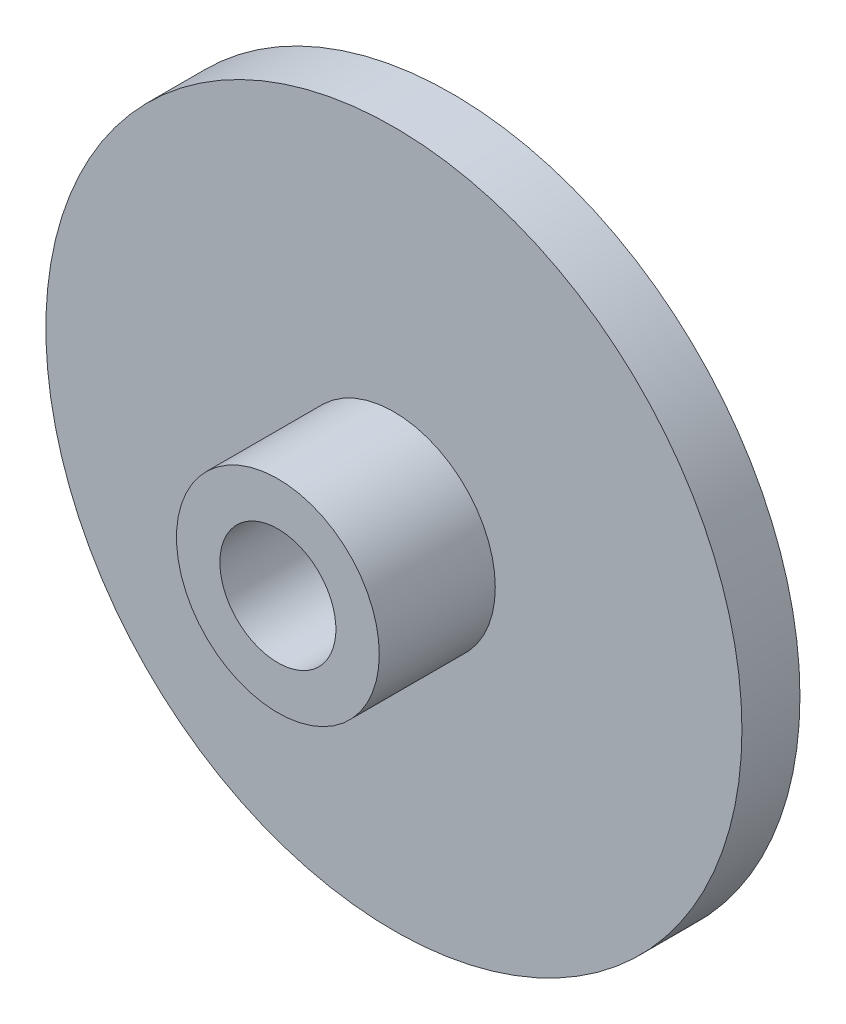
ISO-10303-21;
HEADER;
FILE_DESCRIPTION(('STEP AP214'),'2;1');
FILE_NAME('part.step','',(''),(''),'','','');
FILE_SCHEMA(('AUTOMOTIVE_DESIGN { 1 0 10303 214 1 1 1 1 }'));
ENDSEC;
DATA;
#1=APPLICATION_CONTEXT('core data for automotive mechanical design processes');
#2=APPLICATION_PROTOCOL_DEFINITION('international standard','automotive_design',2000,#1);
#3=PRODUCT_CONTEXT('',#1,'mechanical');
#4=PRODUCT('Part','Part','',(#3));
#5=PRODUCT_RELATED_PRODUCT_CATEGORY('part','',(#4));
#6=PRODUCT_DEFINITION_FORMATION('','',#4);
#7=PRODUCT_DEFINITION_CONTEXT('part definition',#1,'design');
#8=PRODUCT_DEFINITION('design','',#6,#7);
#9=PRODUCT_DEFINITION_SHAPE('','',#8);
#10=(LENGTH_UNIT() NAMED_UNIT(*) SI_UNIT(.MILLI.,.METRE.));
#11=(NAMED_UNIT(*) PLANE_ANGLE_UNIT() SI_UNIT($,.RADIAN.));
#12=(NAMED_UNIT(*) SI_UNIT($,.STERADIAN.) SOLID_ANGLE_UNIT());
#13=UNCERTAINTY_MEASURE_WITH_UNIT(LENGTH_MEASURE(1.E-05),#10,'distance_accuracy_value','');
#14=(GEOMETRIC_REPRESENTATION_CONTEXT(3) GLOBAL_UNCERTAINTY_ASSIGNED_CONTEXT((#13)) GLOBAL_UNIT_ASSIGNED_CONTEXT((#10,
#11,#12)) REPRESENTATION_CONTEXT('',''));
#15=CARTESIAN_POINT('',(0.,0.,0.));
#16=DIRECTION('',(0.,0.,1.));
#17=DIRECTION('',(1.,0.,0.));
#18=AXIS2_PLACEMENT_3D('',#15,#16,#17);
#19=CARTESIAN_POINT('',(0.,0.,3.175));
#20=DIRECTION('',(0.,0.,-1.));
#21=DIRECTION('',(-1.,0.,0.));
#22=AXIS2_PLACEMENT_3D('',#19,#20,#21);
#23=CYLINDRICAL_SURFACE('',#22,19.05);
#24=CARTESIAN_POINT('',(0.,0.,3.175));
#25=DIRECTION('',(0.,0.,1.));
#26=DIRECTION('',(1.,0.,0.));
#27=AXIS2_PLACEMENT_3D('',#24,#25,#26);
#28=CIRCLE('',#27,19.05);
#29=CARTESIAN_POINT('',(19.05,0.,3.175));
#30=VERTEX_POINT('',#29);
#31=EDGE_CURVE('E10',#30,#30,#28,.T.);
#32=ORIENTED_EDGE('',*,*,#31,.F.);
#33=EDGE_LOOP('',(#32));
#34=FACE_BOUND('',#33,.T.);
#35=CARTESIAN_POINT('',(0.,0.,0.));
#36=DIRECTION('',(0.,0.,1.));
#37=DIRECTION('',(1.,0.,0.));
#38=AXIS2_PLACEMENT_3D('',#35,#36,#37);
#39=CIRCLE('',#38,19.05);
#40=CARTESIAN_POINT('',(19.05,0.,0.));
#41=VERTEX_POINT('',#40);
#42=EDGE_CURVE('E34',#41,#41,#39,.T.);
#43=ORIENTED_EDGE('',*,*,#42,.T.);
#44=EDGE_LOOP('',(#43));
#45=FACE_BOUND('',#44,.T.);
#46=ADVANCED_FACE('F31',(#34,#45),#23,.T.);
#47=CARTESIAN_POINT('',(0.,0.,3.175));
#48=DIRECTION('',(0.,0.,1.));
#49=DIRECTION('',(1.,0.,0.));
#50=AXIS2_PLACEMENT_3D('',#47,#48,#49);
#51=PLANE('',#50);
#52=CARTESIAN_POINT('',(0.,0.,3.175));
#53=DIRECTION('',(0.,0.,1.));
#54=DIRECTION('',(1.,0.,0.));
#55=AXIS2_PLACEMENT_3D('',#52,#53,#54);
#56=CIRCLE('',#55,5.5499);
#57=CARTESIAN_POINT('',(5.5499,0.,3.175));
#58=VERTEX_POINT('',#57);
#59=EDGE_CURVE('E43',#58,#58,#56,.T.);
#60=ORIENTED_EDGE('',*,*,#59,.F.);
#61=EDGE_LOOP('',(#60));
#62=FACE_BOUND('',#61,.T.);
#63=ORIENTED_EDGE('',*,*,#31,.T.);
#64=EDGE_LOOP('',(#63));
#65=FACE_BOUND('',#64,.T.);
#66=ADVANCED_FACE('F68',(#62,#65),#51,.T.);
#67=CARTESIAN_POINT('',(0.,0.,0.));
#68=DIRECTION('',(0.,0.,1.));
#69=DIRECTION('',(1.,0.,0.));
#70=AXIS2_PLACEMENT_3D('',#67,#68,#69);
#71=PLANE('',#70);
#72=CARTESIAN_POINT('',(0.,0.,0.));
#73=DIRECTION('',(0.,0.,-1.));
#74=DIRECTION('',(-1.,0.,0.));
#75=AXIS2_PLACEMENT_3D('',#72,#73,#74);
#76=CIRCLE('',#75,3.175);
#77=CARTESIAN_POINT('',(-3.175,0.,0.));
#78=VERTEX_POINT('',#77);
#79=EDGE_CURVE('E49',#78,#78,#76,.T.);
#80=ORIENTED_EDGE('',*,*,#79,.F.);
#81=EDGE_LOOP('',(#80));
#82=FACE_BOUND('',#81,.T.);
#83=ORIENTED_EDGE('',*,*,#42,.F.);
#84=EDGE_LOOP('',(#83));
#85=FACE_BOUND('',#84,.T.);
#86=ADVANCED_FACE('F64',(#82,#85),#71,.F.);
#87=CARTESIAN_POINT('',(0.,0.,9.525));
#88=DIRECTION('',(0.,0.,-1.));
#89=DIRECTION('',(-1.,0.,0.));
#90=AXIS2_PLACEMENT_3D('',#87,#88,#89);
#91=CYLINDRICAL_SURFACE('',#90,5.5499);
#92=CARTESIAN_POINT('',(0.,0.,9.525));
#93=DIRECTION('',(0.,0.,1.));
#94=DIRECTION('',(1.,0.,0.));
#95=AXIS2_PLACEMENT_3D('',#92,#93,#94);
#96=CIRCLE('',#95,5.5499);
#97=CARTESIAN_POINT('',(5.5499,0.,9.525));
#98=VERTEX_POINT('',#97);
#99=EDGE_CURVE('E41',#98,#98,#96,.T.);
#100=ORIENTED_EDGE('',*,*,#99,.F.);
#101=EDGE_LOOP('',(#100));
#102=FACE_BOUND('',#101,.T.);
#103=ORIENTED_EDGE('',*,*,#59,.T.);
#104=EDGE_LOOP('',(#103));
#105=FACE_BOUND('',#104,.T.);
#106=ADVANCED_FACE('F67',(#102,#105),#91,.T.);
#107=CARTESIAN_POINT('',(0.,0.,9.525));
#108=DIRECTION('',(0.,0.,1.));
#109=DIRECTION('',(1.,0.,0.));
#110=AXIS2_PLACEMENT_3D('',#107,#108,#109);
#111=PLANE('',#110);
#112=CARTESIAN_POINT('',(0.,0.,9.525));
#113=DIRECTION('',(0.,0.,-1.));
#114=DIRECTION('',(-1.,0.,0.));
#115=AXIS2_PLACEMENT_3D('',#112,#113,#114);
#116=CIRCLE('',#115,3.175);
#117=CARTESIAN_POINT('',(-3.175,0.,9.525));
#118=VERTEX_POINT('',#117);
#119=EDGE_CURVE('E46',#118,#118,#116,.T.);
#120=ORIENTED_EDGE('',*,*,#119,.T.);
#121=EDGE_LOOP('',(#120));
#122=FACE_BOUND('',#121,.T.);
#123=ORIENTED_EDGE('',*,*,#99,.T.);
#124=EDGE_LOOP('',(#123));
#125=FACE_BOUND('',#124,.T.);
#126=ADVANCED_FACE('F55',(#122,#125),#111,.T.);
#127=CARTESIAN_POINT('',(0.,0.,9.525));
#128=DIRECTION('',(0.,0.,-1.));
#129=DIRECTION('',(-1.,0.,0.));
#130=AXIS2_PLACEMENT_3D('',#127,#128,#129);
#131=CYLINDRICAL_SURFACE('',#130,3.175);
#132=ORIENTED_EDGE('',*,*,#119,.F.);
#133=EDGE_LOOP('',(#132));
#134=FACE_BOUND('',#133,.T.);
#135=ORIENTED_EDGE('',*,*,#79,.T.);
#136=EDGE_LOOP('',(#135));
#137=FACE_BOUND('',#136,.T.);
#138=ADVANCED_FACE('F58',(#134,#137),#131,.F.);
#139=CLOSED_SHELL('',(#46,#66,#86,#106,#126,#138));
#140=MANIFOLD_SOLID_BREP('B2',#139);
#141=ADVANCED_BREP_SHAPE_REPRESENTATION('',(#18,#140),#14);
#142=SHAPE_DEFINITION_REPRESENTATION(#9,#141);
ENDSEC;
END-ISO-10303-21;
